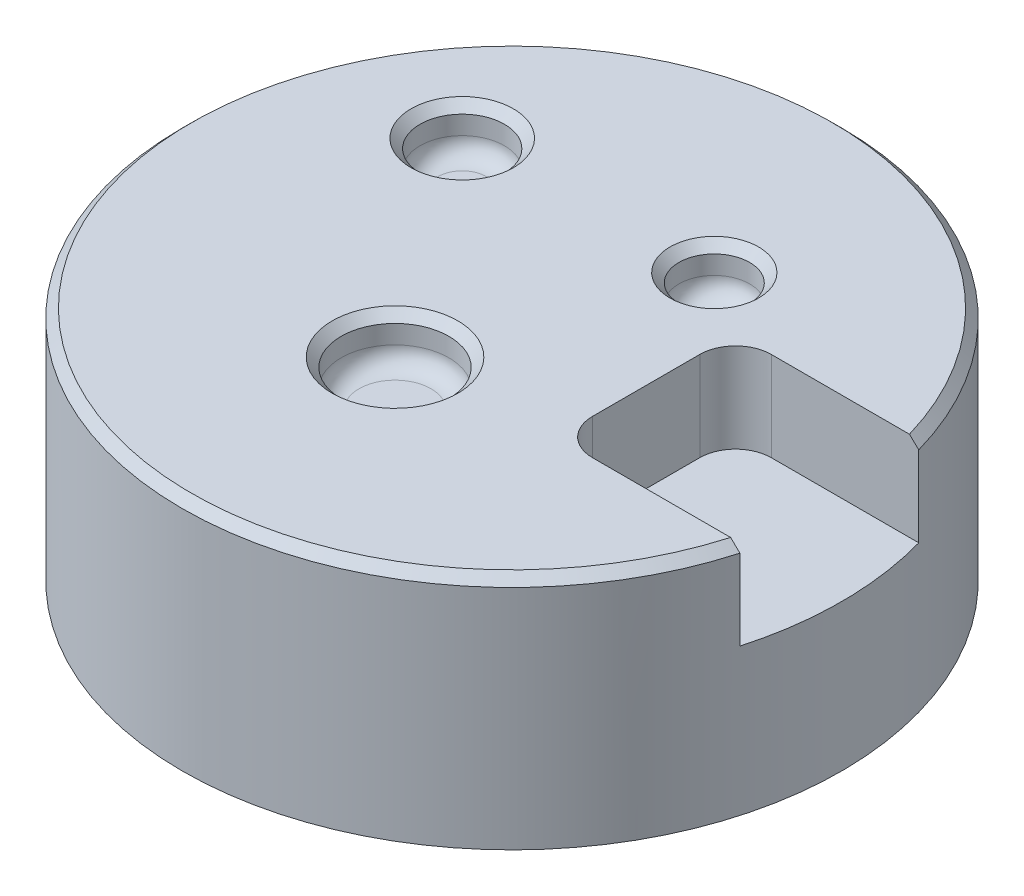
ISO-10303-21;
HEADER;
FILE_DESCRIPTION(('STEP AP214'),'2;1');
FILE_NAME('part.step','',(''),(''),'','','');
FILE_SCHEMA(('AUTOMOTIVE_DESIGN { 1 0 10303 214 1 1 1 1 }'));
ENDSEC;
DATA;
#1=APPLICATION_CONTEXT('core data for automotive mechanical design processes');
#2=APPLICATION_PROTOCOL_DEFINITION('international standard','automotive_design',2000,#1);
#3=PRODUCT_CONTEXT('',#1,'mechanical');
#4=PRODUCT('Part','Part','',(#3));
#5=PRODUCT_RELATED_PRODUCT_CATEGORY('part','',(#4));
#6=PRODUCT_DEFINITION_FORMATION('','',#4);
#7=PRODUCT_DEFINITION_CONTEXT('part definition',#1,'design');
#8=PRODUCT_DEFINITION('design','',#6,#7);
#9=PRODUCT_DEFINITION_SHAPE('','',#8);
#10=(LENGTH_UNIT() NAMED_UNIT(*) SI_UNIT(.MILLI.,.METRE.));
#11=(NAMED_UNIT(*) PLANE_ANGLE_UNIT() SI_UNIT($,.RADIAN.));
#12=(NAMED_UNIT(*) SI_UNIT($,.STERADIAN.) SOLID_ANGLE_UNIT());
#13=UNCERTAINTY_MEASURE_WITH_UNIT(LENGTH_MEASURE(1.E-05),#10,'distance_accuracy_value','');
#14=(GEOMETRIC_REPRESENTATION_CONTEXT(3) GLOBAL_UNCERTAINTY_ASSIGNED_CONTEXT((#13)) GLOBAL_UNIT_ASSIGNED_CONTEXT((#10,
#11,#12)) REPRESENTATION_CONTEXT('',''));
#15=CARTESIAN_POINT('',(0.,0.,0.));
#16=DIRECTION('',(0.,0.,1.));
#17=DIRECTION('',(1.,0.,0.));
#18=AXIS2_PLACEMENT_3D('',#15,#16,#17);
#19=CARTESIAN_POINT('',(0.,26.416,0.));
#20=DIRECTION('',(0.,-1.,0.));
#21=DIRECTION('',(0.,0.,-1.));
#22=AXIS2_PLACEMENT_3D('',#19,#20,#21);
#23=CYLINDRICAL_SURFACE('',#22,36.8716737044278);
#24=CARTESIAN_POINT('',(0.,16.416,0.));
#25=DIRECTION('',(0.,-1.,0.));
#26=DIRECTION('',(0.,0.,-1.));
#27=AXIS2_PLACEMENT_3D('',#24,#25,#26);
#28=CIRCLE('',#27,36.8716737044278);
#29=CARTESIAN_POINT('',(35.4897213537356,16.416,-10.));
#30=VERTEX_POINT('',#29);
#31=CARTESIAN_POINT('',(35.4897213537356,16.416,10.));
#32=VERTEX_POINT('',#31);
#33=EDGE_CURVE('E195',#30,#32,#28,.T.);
#34=ORIENTED_EDGE('',*,*,#33,.T.);
#35=DIRECTION('',(0.,-1.,0.));
#36=VECTOR('',#35,1.);
#37=CARTESIAN_POINT('',(35.4897213537356,26.416,10.));
#38=LINE('',#37,#36);
#39=CARTESIAN_POINT('',(35.4897213537356,25.416,10.));
#40=VERTEX_POINT('',#39);
#41=EDGE_CURVE('E130',#32,#40,#38,.F.);
#42=ORIENTED_EDGE('',*,*,#41,.T.);
#43=CARTESIAN_POINT('',(0.,25.416,0.));
#44=DIRECTION('',(0.,1.,0.));
#45=DIRECTION('',(0.,0.,1.));
#46=AXIS2_PLACEMENT_3D('',#43,#44,#45);
#47=CIRCLE('',#46,36.8716737044278);
#48=CARTESIAN_POINT('',(35.4897213537356,25.416,-10.));
#49=VERTEX_POINT('',#48);
#50=EDGE_CURVE('E112',#40,#49,#47,.F.);
#51=ORIENTED_EDGE('',*,*,#50,.T.);
#52=DIRECTION('',(0.,-1.,0.));
#53=VECTOR('',#52,1.);
#54=CARTESIAN_POINT('',(35.4897213537356,26.416,-10.));
#55=LINE('',#54,#53);
#56=EDGE_CURVE('E105',#49,#30,#55,.T.);
#57=ORIENTED_EDGE('',*,*,#56,.T.);
#58=EDGE_LOOP('',(#34,#42,#51,#57));
#59=FACE_BOUND('',#58,.T.);
#60=CARTESIAN_POINT('',(0.,0.,0.));
#61=DIRECTION('',(0.,1.,0.));
#62=DIRECTION('',(0.,0.,1.));
#63=AXIS2_PLACEMENT_3D('',#60,#61,#62);
#64=CIRCLE('',#63,36.8716737044278);
#65=CARTESIAN_POINT('',(0.,0.,36.8716737044278));
#66=VERTEX_POINT('',#65);
#67=EDGE_CURVE('E124',#66,#66,#64,.T.);
#68=ORIENTED_EDGE('',*,*,#67,.T.);
#69=EDGE_LOOP('',(#68));
#70=FACE_BOUND('',#69,.T.);
#71=ADVANCED_FACE('F40',(#59,#70),#23,.T.);
#72=CARTESIAN_POINT('',(0.,26.416,0.));
#73=DIRECTION('',(0.,1.,0.));
#74=DIRECTION('',(0.,0.,1.));
#75=AXIS2_PLACEMENT_3D('',#72,#73,#74);
#76=PLANE('',#75);
#77=CARTESIAN_POINT('',(-1.78644802110739,26.416,11.2952486855988));
#78=DIRECTION('',(0.,1.,0.));
#79=DIRECTION('',(0.,0.,1.));
#80=AXIS2_PLACEMENT_3D('',#77,#78,#79);
#81=CIRCLE('',#80,7.0254874177872);
#82=CARTESIAN_POINT('',(-1.78644802110739,26.416,18.320736103386));
#83=VERTEX_POINT('',#82);
#84=EDGE_CURVE('E262',#83,#83,#81,.F.);
#85=ORIENTED_EDGE('',*,*,#84,.T.);
#86=EDGE_LOOP('',(#85));
#87=FACE_BOUND('',#86,.T.);
#88=CARTESIAN_POINT('',(7.876648873264,26.416,-14.7482386383331));
#89=DIRECTION('',(0.,1.,0.));
#90=DIRECTION('',(0.,0.,1.));
#91=AXIS2_PLACEMENT_3D('',#88,#89,#90);
#92=CIRCLE('',#91,4.95619356140743);
#93=CARTESIAN_POINT('',(7.876648873264,26.416,-9.79204507692565));
#94=VERTEX_POINT('',#93);
#95=EDGE_CURVE('E258',#94,#94,#92,.F.);
#96=ORIENTED_EDGE('',*,*,#95,.T.);
#97=EDGE_LOOP('',(#96));
#98=FACE_BOUND('',#97,.T.);
#99=CARTESIAN_POINT('',(-19.2212117596,26.416,-13.6555200045336));
#100=DIRECTION('',(0.,1.,0.));
#101=DIRECTION('',(0.,0.,1.));
#102=AXIS2_PLACEMENT_3D('',#99,#100,#101);
#103=CIRCLE('',#102,5.71940122377861);
#104=CARTESIAN_POINT('',(-19.2212117596,26.416,-7.93611878075502));
#105=VERTEX_POINT('',#104);
#106=EDGE_CURVE('E254',#105,#105,#103,.F.);
#107=ORIENTED_EDGE('',*,*,#106,.T.);
#108=EDGE_LOOP('',(#107));
#109=FACE_BOUND('',#108,.T.);
#110=DIRECTION('',(1.,0.,0.));
#111=VECTOR('',#110,1.);
#112=CARTESIAN_POINT('',(15.,26.416,10.));
#113=LINE('',#112,#111);
#114=CARTESIAN_POINT('',(19.,26.416,10.));
#115=VERTEX_POINT('',#114);
#116=CARTESIAN_POINT('',(34.4496295242335,26.416,10.));
#117=VERTEX_POINT('',#116);
#118=EDGE_CURVE('E333',#115,#117,#113,.T.);
#119=ORIENTED_EDGE('',*,*,#118,.F.);
#120=CARTESIAN_POINT('',(19.,26.416,6.));
#121=DIRECTION('',(0.,1.,0.));
#122=DIRECTION('',(0.,0.,1.));
#123=AXIS2_PLACEMENT_3D('',#120,#121,#122);
#124=CIRCLE('',#123,4.);
#125=CARTESIAN_POINT('',(15.,26.416,6.));
#126=VERTEX_POINT('',#125);
#127=EDGE_CURVE('E221',#115,#126,#124,.F.);
#128=ORIENTED_EDGE('',*,*,#127,.T.);
#129=DIRECTION('',(0.,0.,1.));
#130=VECTOR('',#129,1.);
#131=CARTESIAN_POINT('',(15.,26.416,10.));
#132=LINE('',#131,#130);
#133=CARTESIAN_POINT('',(15.,26.416,-6.));
#134=VERTEX_POINT('',#133);
#135=EDGE_CURVE('E119',#134,#126,#132,.T.);
#136=ORIENTED_EDGE('',*,*,#135,.F.);
#137=CARTESIAN_POINT('',(19.,26.416,-6.));
#138=DIRECTION('',(0.,1.,0.));
#139=DIRECTION('',(0.,0.,1.));
#140=AXIS2_PLACEMENT_3D('',#137,#138,#139);
#141=CIRCLE('',#140,4.);
#142=CARTESIAN_POINT('',(19.,26.416,-10.));
#143=VERTEX_POINT('',#142);
#144=EDGE_CURVE('E57',#134,#143,#141,.F.);
#145=ORIENTED_EDGE('',*,*,#144,.T.);
#146=DIRECTION('',(-1.,0.,0.));
#147=VECTOR('',#146,1.);
#148=CARTESIAN_POINT('',(15.,26.416,-10.));
#149=LINE('',#148,#147);
#150=CARTESIAN_POINT('',(34.4496295242335,26.416,-10.));
#151=VERTEX_POINT('',#150);
#152=EDGE_CURVE('E103',#151,#143,#149,.T.);
#153=ORIENTED_EDGE('',*,*,#152,.F.);
#154=CARTESIAN_POINT('',(0.,26.416,0.));
#155=DIRECTION('',(0.,1.,0.));
#156=DIRECTION('',(0.,0.,1.));
#157=AXIS2_PLACEMENT_3D('',#154,#155,#156);
#158=CIRCLE('',#157,35.8716737044279);
#159=EDGE_CURVE('E117',#151,#117,#158,.T.);
#160=ORIENTED_EDGE('',*,*,#159,.T.);
#161=EDGE_LOOP('',(#119,#128,#136,#145,#153,#160));
#162=FACE_BOUND('',#161,.T.);
#163=ADVANCED_FACE('F116',(#87,#98,#109,#162),#76,.T.);
#164=CARTESIAN_POINT('',(0.,0.,0.));
#165=DIRECTION('',(0.,1.,0.));
#166=DIRECTION('',(0.,0.,1.));
#167=AXIS2_PLACEMENT_3D('',#164,#165,#166);
#168=PLANE('',#167);
#169=ORIENTED_EDGE('',*,*,#67,.F.);
#170=EDGE_LOOP('',(#169));
#171=FACE_BOUND('',#170,.T.);
#172=ADVANCED_FACE('F179',(#171),#168,.F.);
#173=CARTESIAN_POINT('',(-1.78644802110739,21.336,11.2952486855988));
#174=DIRECTION('',(0.,1.,0.));
#175=DIRECTION('',(0.,0.,1.));
#176=AXIS2_PLACEMENT_3D('',#173,#174,#175);
#177=CYLINDRICAL_SURFACE('',#176,6.02548741778719);
#178=CARTESIAN_POINT('',(-1.78644802110739,25.416,11.2952486855988));
#179=DIRECTION('',(0.,1.,0.));
#180=DIRECTION('',(0.,0.,1.));
#181=AXIS2_PLACEMENT_3D('',#178,#179,#180);
#182=CIRCLE('',#181,6.02548741778719);
#183=CARTESIAN_POINT('',(-1.78644802110739,25.416,17.320736103386));
#184=VERTEX_POINT('',#183);
#185=EDGE_CURVE('E250',#184,#184,#182,.T.);
#186=ORIENTED_EDGE('',*,*,#185,.T.);
#187=EDGE_LOOP('',(#186));
#188=FACE_BOUND('',#187,.T.);
#189=CARTESIAN_POINT('',(-1.78644802110739,23.336,11.2952486855988));
#190=DIRECTION('',(0.,1.,0.));
#191=DIRECTION('',(0.,0.,1.));
#192=AXIS2_PLACEMENT_3D('',#189,#190,#191);
#193=CIRCLE('',#192,6.02548741778719);
#194=CARTESIAN_POINT('',(-1.78644802110739,23.336,17.320736103386));
#195=VERTEX_POINT('',#194);
#196=EDGE_CURVE('E230',#195,#195,#193,.F.);
#197=ORIENTED_EDGE('',*,*,#196,.T.);
#198=EDGE_LOOP('',(#197));
#199=FACE_BOUND('',#198,.T.);
#200=ADVANCED_FACE('F175',(#188,#199),#177,.F.);
#201=CARTESIAN_POINT('',(-1.78644802110739,21.336,11.2952486855988));
#202=DIRECTION('',(0.,1.,0.));
#203=DIRECTION('',(0.,0.,1.));
#204=AXIS2_PLACEMENT_3D('',#201,#202,#203);
#205=PLANE('',#204);
#206=CARTESIAN_POINT('',(-1.78644802110739,21.336,11.2952486855988));
#207=DIRECTION('',(0.,1.,0.));
#208=DIRECTION('',(0.,0.,1.));
#209=AXIS2_PLACEMENT_3D('',#206,#207,#208);
#210=CIRCLE('',#209,4.02548741778719);
#211=CARTESIAN_POINT('',(-1.78644802110739,21.336,15.320736103386));
#212=VERTEX_POINT('',#211);
#213=EDGE_CURVE('E226',#212,#212,#210,.T.);
#214=ORIENTED_EDGE('',*,*,#213,.T.);
#215=EDGE_LOOP('',(#214));
#216=FACE_BOUND('',#215,.T.);
#217=ADVANCED_FACE('F171',(#216),#205,.T.);
#218=CARTESIAN_POINT('',(7.876648873264,21.336,-14.7482386383331));
#219=DIRECTION('',(0.,1.,0.));
#220=DIRECTION('',(0.,0.,1.));
#221=AXIS2_PLACEMENT_3D('',#218,#219,#220);
#222=CYLINDRICAL_SURFACE('',#221,3.95619356140742);
#223=CARTESIAN_POINT('',(7.876648873264,25.416,-14.7482386383331));
#224=DIRECTION('',(0.,1.,0.));
#225=DIRECTION('',(0.,0.,1.));
#226=AXIS2_PLACEMENT_3D('',#223,#224,#225);
#227=CIRCLE('',#226,3.95619356140742);
#228=CARTESIAN_POINT('',(7.876648873264,25.416,-10.7920450769257));
#229=VERTEX_POINT('',#228);
#230=EDGE_CURVE('E50',#229,#229,#227,.T.);
#231=ORIENTED_EDGE('',*,*,#230,.T.);
#232=EDGE_LOOP('',(#231));
#233=FACE_BOUND('',#232,.T.);
#234=CARTESIAN_POINT('',(7.876648873264,23.336,-14.7482386383331));
#235=DIRECTION('',(0.,1.,0.));
#236=DIRECTION('',(0.,0.,1.));
#237=AXIS2_PLACEMENT_3D('',#234,#235,#236);
#238=CIRCLE('',#237,3.95619356140742);
#239=CARTESIAN_POINT('',(7.876648873264,23.336,-10.7920450769257));
#240=VERTEX_POINT('',#239);
#241=EDGE_CURVE('E238',#240,#240,#238,.F.);
#242=ORIENTED_EDGE('',*,*,#241,.T.);
#243=EDGE_LOOP('',(#242));
#244=FACE_BOUND('',#243,.T.);
#245=ADVANCED_FACE('F167',(#233,#244),#222,.F.);
#246=CARTESIAN_POINT('',(7.876648873264,21.336,-14.7482386383331));
#247=DIRECTION('',(0.,1.,0.));
#248=DIRECTION('',(0.,0.,1.));
#249=AXIS2_PLACEMENT_3D('',#246,#247,#248);
#250=PLANE('',#249);
#251=CARTESIAN_POINT('',(7.876648873264,21.336,-14.7482386383331));
#252=DIRECTION('',(0.,1.,0.));
#253=DIRECTION('',(0.,0.,1.));
#254=AXIS2_PLACEMENT_3D('',#251,#252,#253);
#255=CIRCLE('',#254,1.95619356140742);
#256=CARTESIAN_POINT('',(7.876648873264,21.336,-12.7920450769257));
#257=VERTEX_POINT('',#256);
#258=EDGE_CURVE('E234',#257,#257,#255,.T.);
#259=ORIENTED_EDGE('',*,*,#258,.T.);
#260=EDGE_LOOP('',(#259));
#261=FACE_BOUND('',#260,.T.);
#262=ADVANCED_FACE('F163',(#261),#250,.T.);
#263=CARTESIAN_POINT('',(-19.2212117596,21.336,-13.6555200045336));
#264=DIRECTION('',(0.,1.,0.));
#265=DIRECTION('',(0.,0.,1.));
#266=AXIS2_PLACEMENT_3D('',#263,#264,#265);
#267=CYLINDRICAL_SURFACE('',#266,4.71940122377859);
#268=CARTESIAN_POINT('',(-19.2212117596,25.416,-13.6555200045336));
#269=DIRECTION('',(0.,1.,0.));
#270=DIRECTION('',(0.,0.,1.));
#271=AXIS2_PLACEMENT_3D('',#268,#269,#270);
#272=CIRCLE('',#271,4.71940122377859);
#273=CARTESIAN_POINT('',(-19.2212117596,25.416,-8.93611878075504));
#274=VERTEX_POINT('',#273);
#275=EDGE_CURVE('E11',#274,#274,#272,.T.);
#276=ORIENTED_EDGE('',*,*,#275,.T.);
#277=EDGE_LOOP('',(#276));
#278=FACE_BOUND('',#277,.T.);
#279=CARTESIAN_POINT('',(-19.2212117596,23.336,-13.6555200045336));
#280=DIRECTION('',(0.,1.,0.));
#281=DIRECTION('',(0.,0.,1.));
#282=AXIS2_PLACEMENT_3D('',#279,#280,#281);
#283=CIRCLE('',#282,4.71940122377859);
#284=CARTESIAN_POINT('',(-19.2212117596,23.336,-8.93611878075504));
#285=VERTEX_POINT('',#284);
#286=EDGE_CURVE('E246',#285,#285,#283,.F.);
#287=ORIENTED_EDGE('',*,*,#286,.T.);
#288=EDGE_LOOP('',(#287));
#289=FACE_BOUND('',#288,.T.);
#290=ADVANCED_FACE('F159',(#278,#289),#267,.F.);
#291=CARTESIAN_POINT('',(-19.2212117596,21.336,-13.6555200045336));
#292=DIRECTION('',(0.,1.,0.));
#293=DIRECTION('',(0.,0.,1.));
#294=AXIS2_PLACEMENT_3D('',#291,#292,#293);
#295=PLANE('',#294);
#296=CARTESIAN_POINT('',(-19.2212117596,21.336,-13.6555200045336));
#297=DIRECTION('',(0.,1.,0.));
#298=DIRECTION('',(0.,0.,1.));
#299=AXIS2_PLACEMENT_3D('',#296,#297,#298);
#300=CIRCLE('',#299,2.71940122377859);
#301=CARTESIAN_POINT('',(-19.2212117596,21.336,-10.936118780755));
#302=VERTEX_POINT('',#301);
#303=EDGE_CURVE('E242',#302,#302,#300,.T.);
#304=ORIENTED_EDGE('',*,*,#303,.T.);
#305=EDGE_LOOP('',(#304));
#306=FACE_BOUND('',#305,.T.);
#307=ADVANCED_FACE('F156',(#306),#295,.T.);
#308=CARTESIAN_POINT('',(0.,26.416,0.));
#309=DIRECTION('',(0.,-1.,0.));
#310=DIRECTION('',(0.,0.,-1.));
#311=AXIS2_PLACEMENT_3D('',#308,#309,#310);
#312=CONICAL_SURFACE('',#311,35.8716737044279,0.785398163397434);
#313=CARTESIAN_POINT('',(9.76499708550384,48.3107223887839,10.));
#314=CARTESIAN_POINT('',(10.04624807416,48.1141822061452,10.));
#315=CARTESIAN_POINT('',(10.3254846953666,47.9147922197904,10.));
#316=CARTESIAN_POINT('',(10.8803769221913,47.511137236422,10.));
#317=CARTESIAN_POINT('',(11.1560328469638,47.3068726785569,10.));
#318=CARTESIAN_POINT('',(11.7041696058035,46.894326904971,10.));
#319=CARTESIAN_POINT('',(11.9766514756682,46.6860470620294,10.));
#320=CARTESIAN_POINT('',(12.5189216463382,46.266000351831,10.));
#321=CARTESIAN_POINT('',(12.7887098775343,46.0542333948329,10.));
#322=CARTESIAN_POINT('',(13.5940534129721,45.4148714006233,10.));
#323=CARTESIAN_POINT('',(14.1260857246039,44.9828373663025,10.));
#324=CARTESIAN_POINT('',(15.1828811592015,44.1099010651293,10.));
#325=CARTESIAN_POINT('',(15.7076435431677,43.6689979077255,10.));
#326=CARTESIAN_POINT('',(16.750883546343,42.7808202498872,10.));
#327=CARTESIAN_POINT('',(17.2693666411449,42.3335521710744,10.));
#328=CARTESIAN_POINT('',(18.3016753701244,41.4337196918782,10.));
#329=CARTESIAN_POINT('',(18.8155011714005,40.9811554828595,10.));
#330=CARTESIAN_POINT('',(19.8395299051609,40.0716526211959,10.));
#331=CARTESIAN_POINT('',(20.349731740305,39.614712734358,10.));
#332=CARTESIAN_POINT('',(21.3670314886471,38.6973843098576,10.));
#333=CARTESIAN_POINT('',(21.8741293717324,38.2369957388342,10.));
#334=CARTESIAN_POINT('',(23.1385318780904,37.082601951915,10.));
#335=CARTESIAN_POINT('',(23.8942253834268,36.3868326069728,10.));
#336=CARTESIAN_POINT('',(25.4011379199337,34.990461799825,10.));
#337=CARTESIAN_POINT('',(26.1523569191716,34.2898603032113,10.));
#338=CARTESIAN_POINT('',(27.6512714277241,32.8848736656135,10.));
#339=CARTESIAN_POINT('',(28.3989668735675,32.1804884569574,10.));
#340=CARTESIAN_POINT('',(29.8915222862769,30.7687189908915,10.));
#341=CARTESIAN_POINT('',(30.636382247036,30.0613347270296,10.));
#342=CARTESIAN_POINT('',(32.1237544925115,28.6441807132669,10.));
#343=CARTESIAN_POINT('',(32.8662668974353,27.9344110894783,10.));
#344=CARTESIAN_POINT('',(34.3493854727887,26.5128825637306,10.));
#345=CARTESIAN_POINT('',(35.089991641618,25.8011236601025,10.));
#346=CARTESIAN_POINT('',(37.3094214007885,23.6634076980387,10.));
#347=CARTESIAN_POINT('',(38.7858766703548,22.2349918876905,10.));
#348=CARTESIAN_POINT('',(41.7373553762602,19.3705363013988,10.));
#349=CARTESIAN_POINT('',(43.2123694002303,17.9344868372635,10.));
#350=CARTESIAN_POINT('',(46.1590402045927,15.0589362920258,10.));
#351=CARTESIAN_POINT('',(47.6306969708991,13.6194351964935,10.));
#352=CARTESIAN_POINT('',(50.5713179779119,10.7379710039351,10.));
#353=CARTESIAN_POINT('',(52.0402824654507,9.29600815870291,10.));
#354=CARTESIAN_POINT('',(54.9761851686462,6.41003988233519,10.));
#355=CARTESIAN_POINT('',(56.4431233973524,4.96603446447668,10.));
#356=CARTESIAN_POINT('',(57.9093197143964,3.52127761121609,10.));
#357=B_SPLINE_CURVE_WITH_KNOTS('',3,(#313,#314,#315,#316,#317,#318,#319,#320,#321,#322,#323,
#324,#325,#326,#327,#328,#329,#330,#331,#332,#333,#334,#335,#336,#337,#338,#339,#340,#341,#342,
#343,#344,#345,#346,#347,#348,#349,#350,#351,#352,#353,#354,#355,#356),.UNSPECIFIED.,.F.,.F.,(4,
2,2,2,2,2,2,2,2,2,2,2,2,2,2,2,2,2,2,2,2,4),(0.,1.02930988575081,2.05852738877907,
3.08739904462008,4.11629722014131,6.17221823820278,8.22834673268689,10.2825301981628,
12.3366396677624,14.3913466600888,16.4460735544171,19.5276839065648,22.6093162245295,
25.6910038426058,28.7726980939558,31.8542319039224,34.9357682999767,41.0987563716408,
47.2746011859022,53.4504718643956,59.6257447552145,65.8009776885919),.UNSPECIFIED.);
#358=EDGE_CURVE('E111',#117,#40,#357,.T.);
#359=ORIENTED_EDGE('',*,*,#358,.F.);
#360=ORIENTED_EDGE('',*,*,#159,.F.);
#361=CARTESIAN_POINT('',(57.9093197143964,3.52127761121609,-10.));
#362=CARTESIAN_POINT('',(56.9332614608396,4.48309645442977,-10.));
#363=CARTESIAN_POINT('',(55.9568564005258,5.44456318647407,-10.));
#364=CARTESIAN_POINT('',(54.0032241225571,7.36666069142511,-10.));
#365=CARTESIAN_POINT('',(53.0259969050182,8.32729146444979,-10.));
#366=CARTESIAN_POINT('',(50.0931338721846,11.207491963019,-10.));
#367=CARTESIAN_POINT('',(48.1360720688165,13.1256110368988,-10.));
#368=CARTESIAN_POINT('',(45.1969952466582,15.9980865990618,-10.));
#369=CARTESIAN_POINT('',(44.2170075015079,16.9545174283288,-10.));
#370=CARTESIAN_POINT('',(42.2553877803213,18.8656884631059,-10.));
#371=CARTESIAN_POINT('',(41.2737558071796,19.8204286715862,-10.));
#372=CARTESIAN_POINT('',(39.3083569250608,21.7279538861556,-10.));
#373=CARTESIAN_POINT('',(38.3245897663571,22.6807386350174,-10.));
#374=CARTESIAN_POINT('',(36.3545444800874,24.5837227887623,-10.));
#375=CARTESIAN_POINT('',(35.3682663358188,25.5339221763608,-10.));
#376=CARTESIAN_POINT('',(33.3915272171179,27.4320040008118,-10.));
#377=CARTESIAN_POINT('',(32.4010629801963,28.3798830421118,-10.));
#378=CARTESIAN_POINT('',(30.4160659956577,30.271328477451,-10.));
#379=CARTESIAN_POINT('',(29.4215333411135,31.2148949691138,-10.));
#380=CARTESIAN_POINT('',(27.4274013229437,33.096023688374,-10.));
#381=CARTESIAN_POINT('',(26.4278036936806,34.0335877512894,-10.));
#382=CARTESIAN_POINT('',(24.9228691497121,35.4340712254375,-10.));
#383=CARTESIAN_POINT('',(24.4202790376809,35.8999423266804,-10.));
#384=CARTESIAN_POINT('',(23.4129267017169,36.8293293260706,-10.));
#385=CARTESIAN_POINT('',(22.9081644829619,37.2928452298264,-10.));
#386=CARTESIAN_POINT('',(21.8954926348025,38.2175687635155,-10.));
#387=CARTESIAN_POINT('',(21.3875801166747,38.6787732320593,-10.));
#388=CARTESIAN_POINT('',(20.3686495600303,39.59773275703,-10.));
#389=CARTESIAN_POINT('',(19.8576315494572,40.055487844412,-10.));
#390=CARTESIAN_POINT('',(18.8319388832773,40.9666408512245,-10.));
#391=CARTESIAN_POINT('',(18.3172651255601,41.4200397803116,-10.));
#392=CARTESIAN_POINT('',(17.2832542407603,42.3215350971891,-10.));
#393=CARTESIAN_POINT('',(16.7639169488149,42.7696312962119,-10.));
#394=CARTESIAN_POINT('',(15.7188289412188,43.6595658433651,-10.));
#395=CARTESIAN_POINT('',(15.1930713085222,44.1013960810772,-10.));
#396=CARTESIAN_POINT('',(14.1342668545618,44.9761659914943,-10.));
#397=CARTESIAN_POINT('',(13.6012207731507,45.4091065555939,-10.));
#398=CARTESIAN_POINT('',(12.7943560690622,46.0497874536705,-10.));
#399=CARTESIAN_POINT('',(12.5240710620652,46.2619793790782,-10.));
#400=CARTESIAN_POINT('',(11.9807991497501,46.6828659140066,-10.));
#401=CARTESIAN_POINT('',(11.7078123145556,46.8915606139181,-10.));
#402=CARTESIAN_POINT('',(11.1586552984078,47.3049234023167,-10.));
#403=CARTESIAN_POINT('',(10.882484077714,47.5095901129745,-10.));
#404=CARTESIAN_POINT('',(10.3265484654625,47.9140324506384,-10.));
#405=CARTESIAN_POINT('',(10.0467837522493,48.1138076350839,-10.));
#406=CARTESIAN_POINT('',(9.76499708550391,48.310722388784,-10.));
#407=B_SPLINE_CURVE_WITH_KNOTS('',3,(#361,#362,#363,#364,#365,#366,#367,#368,#369,#370,#371,
#372,#373,#374,#375,#376,#377,#378,#379,#380,#381,#382,#383,#384,#385,#386,#387,#388,#389,#390,
#391,#392,#393,#394,#395,#396,#397,#398,#399,#400,#401,#402,#403,#404,#405,#406),.UNSPECIFIED.,
.F.,.F.,(4,2,2,2,2,2,2,2,2,2,2,2,2,2,2,2,2,2,2,2,2,2,4),(0.,4.110968671972,8.22193676387984,
16.442842435095,20.5509089826277,24.658968305301,28.7675372185234,32.8761335326325,
36.9889626877371,41.1016982745175,45.2131097298973,47.268996477469,49.3248783268994,
51.3830595002031,53.4412221811061,55.4988957255043,57.5566423003553,59.6168457465946,
61.6768415910521,62.7076991768138,63.738530077345,64.7697076653415,65.8009782068839),.UNSPECIFIED.);
#408=EDGE_CURVE('E101',#49,#151,#407,.T.);
#409=ORIENTED_EDGE('',*,*,#408,.F.);
#410=ORIENTED_EDGE('',*,*,#50,.F.);
#411=EDGE_LOOP('',(#359,#360,#409,#410));
#412=FACE_BOUND('',#411,.T.);
#413=ADVANCED_FACE('F122',(#412),#312,.T.);
#414=CARTESIAN_POINT('',(0.,16.416,0.));
#415=DIRECTION('',(0.,-1.,0.));
#416=DIRECTION('',(0.,0.,-1.));
#417=AXIS2_PLACEMENT_3D('',#414,#415,#416);
#418=PLANE('',#417);
#419=DIRECTION('',(0.,0.,1.));
#420=VECTOR('',#419,1.);
#421=CARTESIAN_POINT('',(15.,16.416,10.));
#422=LINE('',#421,#420);
#423=CARTESIAN_POINT('',(15.,16.416,-6.));
#424=VERTEX_POINT('',#423);
#425=CARTESIAN_POINT('',(15.,16.416,6.));
#426=VERTEX_POINT('',#425);
#427=EDGE_CURVE('E319',#424,#426,#422,.T.);
#428=ORIENTED_EDGE('',*,*,#427,.T.);
#429=CARTESIAN_POINT('',(19.,16.416,6.));
#430=DIRECTION('',(0.,-1.,0.));
#431=DIRECTION('',(0.,0.,-1.));
#432=AXIS2_PLACEMENT_3D('',#429,#430,#431);
#433=CIRCLE('',#432,4.);
#434=CARTESIAN_POINT('',(19.,16.416,10.));
#435=VERTEX_POINT('',#434);
#436=EDGE_CURVE('E216',#426,#435,#433,.F.);
#437=ORIENTED_EDGE('',*,*,#436,.T.);
#438=DIRECTION('',(1.,0.,0.));
#439=VECTOR('',#438,1.);
#440=CARTESIAN_POINT('',(15.,16.416,10.));
#441=LINE('',#440,#439);
#442=EDGE_CURVE('E317',#435,#32,#441,.T.);
#443=ORIENTED_EDGE('',*,*,#442,.T.);
#444=ORIENTED_EDGE('',*,*,#33,.F.);
#445=DIRECTION('',(-1.,0.,0.));
#446=VECTOR('',#445,1.);
#447=CARTESIAN_POINT('',(15.,16.416,-10.));
#448=LINE('',#447,#446);
#449=CARTESIAN_POINT('',(19.,16.416,-10.));
#450=VERTEX_POINT('',#449);
#451=EDGE_CURVE('E326',#30,#450,#448,.T.);
#452=ORIENTED_EDGE('',*,*,#451,.T.);
#453=CARTESIAN_POINT('',(19.,16.416,-6.));
#454=DIRECTION('',(0.,-1.,0.));
#455=DIRECTION('',(0.,0.,-1.));
#456=AXIS2_PLACEMENT_3D('',#453,#454,#455);
#457=CIRCLE('',#456,4.);
#458=EDGE_CURVE('E213',#450,#424,#457,.F.);
#459=ORIENTED_EDGE('',*,*,#458,.T.);
#460=EDGE_LOOP('',(#428,#437,#443,#444,#452,#459));
#461=FACE_BOUND('',#460,.T.);
#462=ADVANCED_FACE('F316',(#461),#418,.F.);
#463=CARTESIAN_POINT('',(15.,16.416,10.));
#464=DIRECTION('',(0.,0.,1.));
#465=DIRECTION('',(1.,0.,0.));
#466=AXIS2_PLACEMENT_3D('',#463,#464,#465);
#467=PLANE('',#466);
#468=ORIENTED_EDGE('',*,*,#442,.F.);
#469=DIRECTION('',(0.,1.,0.));
#470=VECTOR('',#469,1.);
#471=CARTESIAN_POINT('',(19.,26.416,10.));
#472=LINE('',#471,#470);
#473=EDGE_CURVE('E200',#435,#115,#472,.T.);
#474=ORIENTED_EDGE('',*,*,#473,.T.);
#475=ORIENTED_EDGE('',*,*,#118,.T.);
#476=ORIENTED_EDGE('',*,*,#358,.T.);
#477=ORIENTED_EDGE('',*,*,#41,.F.);
#478=EDGE_LOOP('',(#468,#474,#475,#476,#477));
#479=FACE_BOUND('',#478,.T.);
#480=ADVANCED_FACE('F155',(#479),#467,.F.);
#481=CARTESIAN_POINT('',(15.,16.416,-10.));
#482=DIRECTION('',(0.,0.,-1.));
#483=DIRECTION('',(-1.,0.,0.));
#484=AXIS2_PLACEMENT_3D('',#481,#482,#483);
#485=PLANE('',#484);
#486=ORIENTED_EDGE('',*,*,#152,.T.);
#487=DIRECTION('',(0.,1.,0.));
#488=VECTOR('',#487,1.);
#489=CARTESIAN_POINT('',(19.,16.416,-10.));
#490=LINE('',#489,#488);
#491=EDGE_CURVE('E64',#143,#450,#490,.F.);
#492=ORIENTED_EDGE('',*,*,#491,.T.);
#493=ORIENTED_EDGE('',*,*,#451,.F.);
#494=ORIENTED_EDGE('',*,*,#56,.F.);
#495=ORIENTED_EDGE('',*,*,#408,.T.);
#496=EDGE_LOOP('',(#486,#492,#493,#494,#495));
#497=FACE_BOUND('',#496,.T.);
#498=ADVANCED_FACE('F102',(#497),#485,.F.);
#499=CARTESIAN_POINT('',(15.,16.416,10.));
#500=DIRECTION('',(-1.,0.,0.));
#501=DIRECTION('',(0.,0.,1.));
#502=AXIS2_PLACEMENT_3D('',#499,#500,#501);
#503=PLANE('',#502);
#504=ORIENTED_EDGE('',*,*,#135,.T.);
#505=DIRECTION('',(0.,1.,0.));
#506=VECTOR('',#505,1.);
#507=CARTESIAN_POINT('',(15.,16.416,6.));
#508=LINE('',#507,#506);
#509=EDGE_CURVE('E210',#126,#426,#508,.F.);
#510=ORIENTED_EDGE('',*,*,#509,.T.);
#511=ORIENTED_EDGE('',*,*,#427,.F.);
#512=DIRECTION('',(0.,1.,0.));
#513=VECTOR('',#512,1.);
#514=CARTESIAN_POINT('',(15.,26.416,-6.));
#515=LINE('',#514,#513);
#516=EDGE_CURVE('E204',#424,#134,#515,.T.);
#517=ORIENTED_EDGE('',*,*,#516,.T.);
#518=EDGE_LOOP('',(#504,#510,#511,#517));
#519=FACE_BOUND('',#518,.T.);
#520=ADVANCED_FACE('F154',(#519),#503,.F.);
#521=CARTESIAN_POINT('',(19.,16.416,6.));
#522=DIRECTION('',(0.,-1.,0.));
#523=DIRECTION('',(0.,0.,-1.));
#524=AXIS2_PLACEMENT_3D('',#521,#522,#523);
#525=CYLINDRICAL_SURFACE('',#524,4.);
#526=ORIENTED_EDGE('',*,*,#436,.F.);
#527=ORIENTED_EDGE('',*,*,#509,.F.);
#528=ORIENTED_EDGE('',*,*,#127,.F.);
#529=ORIENTED_EDGE('',*,*,#473,.F.);
#530=EDGE_LOOP('',(#526,#527,#528,#529));
#531=FACE_BOUND('',#530,.T.);
#532=ADVANCED_FACE('F303',(#531),#525,.F.);
#533=CARTESIAN_POINT('',(19.,16.416,-6.));
#534=DIRECTION('',(0.,-1.,0.));
#535=DIRECTION('',(0.,0.,-1.));
#536=AXIS2_PLACEMENT_3D('',#533,#534,#535);
#537=CYLINDRICAL_SURFACE('',#536,4.);
#538=ORIENTED_EDGE('',*,*,#458,.F.);
#539=ORIENTED_EDGE('',*,*,#491,.F.);
#540=ORIENTED_EDGE('',*,*,#144,.F.);
#541=ORIENTED_EDGE('',*,*,#516,.F.);
#542=EDGE_LOOP('',(#538,#539,#540,#541));
#543=FACE_BOUND('',#542,.T.);
#544=ADVANCED_FACE('F300',(#543),#537,.F.);
#545=CARTESIAN_POINT('',(-1.78644802110739,23.336,11.2952486855988));
#546=DIRECTION('',(0.,1.,0.));
#547=DIRECTION('',(0.,0.,1.));
#548=AXIS2_PLACEMENT_3D('',#545,#546,#547);
#549=TOROIDAL_SURFACE('',#548,4.02548741778719,2.);
#550=ORIENTED_EDGE('',*,*,#196,.F.);
#551=EDGE_LOOP('',(#550));
#552=FACE_BOUND('',#551,.T.);
#553=ORIENTED_EDGE('',*,*,#213,.F.);
#554=EDGE_LOOP('',(#553));
#555=FACE_BOUND('',#554,.T.);
#556=ADVANCED_FACE('F296',(#552,#555),#549,.F.);
#557=CARTESIAN_POINT('',(7.876648873264,23.336,-14.7482386383331));
#558=DIRECTION('',(0.,1.,0.));
#559=DIRECTION('',(0.,0.,1.));
#560=AXIS2_PLACEMENT_3D('',#557,#558,#559);
#561=DEGENERATE_TOROIDAL_SURFACE('',#560,1.95619356140742,2.,.T.);
#562=ORIENTED_EDGE('',*,*,#241,.F.);
#563=EDGE_LOOP('',(#562));
#564=FACE_BOUND('',#563,.T.);
#565=ORIENTED_EDGE('',*,*,#258,.F.);
#566=EDGE_LOOP('',(#565));
#567=FACE_BOUND('',#566,.T.);
#568=ADVANCED_FACE('F292',(#564,#567),#561,.F.);
#569=CARTESIAN_POINT('',(-19.2212117596,23.336,-13.6555200045336));
#570=DIRECTION('',(0.,1.,0.));
#571=DIRECTION('',(0.,0.,1.));
#572=AXIS2_PLACEMENT_3D('',#569,#570,#571);
#573=TOROIDAL_SURFACE('',#572,2.71940122377859,2.);
#574=ORIENTED_EDGE('',*,*,#286,.F.);
#575=EDGE_LOOP('',(#574));
#576=FACE_BOUND('',#575,.T.);
#577=ORIENTED_EDGE('',*,*,#303,.F.);
#578=EDGE_LOOP('',(#577));
#579=FACE_BOUND('',#578,.T.);
#580=ADVANCED_FACE('F279',(#576,#579),#573,.F.);
#581=CARTESIAN_POINT('',(-1.78644802110739,25.416,11.2952486855988));
#582=DIRECTION('',(0.,1.,0.));
#583=DIRECTION('',(0.,0.,1.));
#584=AXIS2_PLACEMENT_3D('',#581,#582,#583);
#585=CONICAL_SURFACE('',#584,6.02548741778719,0.785398163397452);
#586=ORIENTED_EDGE('',*,*,#84,.F.);
#587=EDGE_LOOP('',(#586));
#588=FACE_BOUND('',#587,.T.);
#589=ORIENTED_EDGE('',*,*,#185,.F.);
#590=EDGE_LOOP('',(#589));
#591=FACE_BOUND('',#590,.T.);
#592=ADVANCED_FACE('F272',(#588,#591),#585,.F.);
#593=CARTESIAN_POINT('',(7.876648873264,25.416,-14.7482386383331));
#594=DIRECTION('',(0.,1.,0.));
#595=DIRECTION('',(0.,0.,1.));
#596=AXIS2_PLACEMENT_3D('',#593,#594,#595);
#597=CONICAL_SURFACE('',#596,3.95619356140742,0.785398163397448);
#598=ORIENTED_EDGE('',*,*,#95,.F.);
#599=EDGE_LOOP('',(#598));
#600=FACE_BOUND('',#599,.T.);
#601=ORIENTED_EDGE('',*,*,#230,.F.);
#602=EDGE_LOOP('',(#601));
#603=FACE_BOUND('',#602,.T.);
#604=ADVANCED_FACE('F270',(#600,#603),#597,.F.);
#605=CARTESIAN_POINT('',(-19.2212117596,25.416,-13.6555200045336));
#606=DIRECTION('',(0.,1.,0.));
#607=DIRECTION('',(0.,0.,1.));
#608=AXIS2_PLACEMENT_3D('',#605,#606,#607);
#609=CONICAL_SURFACE('',#608,4.71940122377859,0.785398163397447);
#610=ORIENTED_EDGE('',*,*,#106,.F.);
#611=EDGE_LOOP('',(#610));
#612=FACE_BOUND('',#611,.T.);
#613=ORIENTED_EDGE('',*,*,#275,.F.);
#614=EDGE_LOOP('',(#613));
#615=FACE_BOUND('',#614,.T.);
#616=ADVANCED_FACE('F43',(#612,#615),#609,.F.);
#617=CLOSED_SHELL('',(#71,#163,#172,#200,#217,#245,#262,#290,#307,#413,#462,#480,#498,#520,#532,
#544,#556,#568,#580,#592,#604,#616));
#618=MANIFOLD_SOLID_BREP('B2',#617);
#619=ADVANCED_BREP_SHAPE_REPRESENTATION('',(#18,#618),#14);
#620=SHAPE_DEFINITION_REPRESENTATION(#9,#619);
ENDSEC;
END-ISO-10303-21;
